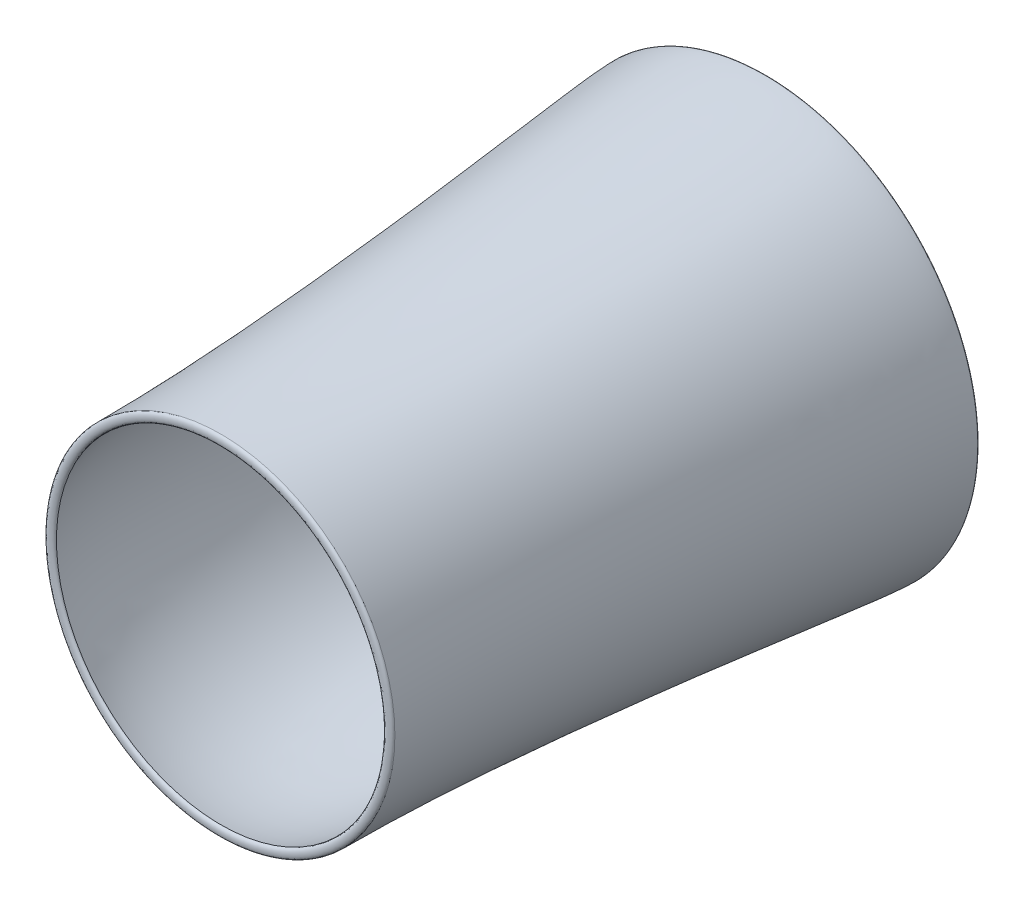
ISO-10303-21;
HEADER;
FILE_DESCRIPTION(('STEP AP214'),'2;1');
FILE_NAME('part.step','',(''),(''),'','','');
FILE_SCHEMA(('AUTOMOTIVE_DESIGN { 1 0 10303 214 1 1 1 1 }'));
ENDSEC;
DATA;
#1=APPLICATION_CONTEXT('core data for automotive mechanical design processes');
#2=APPLICATION_PROTOCOL_DEFINITION('international standard','automotive_design',2000,#1);
#3=PRODUCT_CONTEXT('',#1,'mechanical');
#4=PRODUCT('Part','Part','',(#3));
#5=PRODUCT_RELATED_PRODUCT_CATEGORY('part','',(#4));
#6=PRODUCT_DEFINITION_FORMATION('','',#4);
#7=PRODUCT_DEFINITION_CONTEXT('part definition',#1,'design');
#8=PRODUCT_DEFINITION('design','',#6,#7);
#9=PRODUCT_DEFINITION_SHAPE('','',#8);
#10=(LENGTH_UNIT() NAMED_UNIT(*) SI_UNIT(.MILLI.,.METRE.));
#11=(NAMED_UNIT(*) PLANE_ANGLE_UNIT() SI_UNIT($,.RADIAN.));
#12=(NAMED_UNIT(*) SI_UNIT($,.STERADIAN.) SOLID_ANGLE_UNIT());
#13=UNCERTAINTY_MEASURE_WITH_UNIT(LENGTH_MEASURE(1.E-05),#10,'distance_accuracy_value','');
#14=(GEOMETRIC_REPRESENTATION_CONTEXT(3) GLOBAL_UNCERTAINTY_ASSIGNED_CONTEXT((#13)) GLOBAL_UNIT_ASSIGNED_CONTEXT((#10,
#11,#12)) REPRESENTATION_CONTEXT('',''));
#15=CARTESIAN_POINT('',(0.,0.,0.));
#16=DIRECTION('',(0.,0.,1.));
#17=DIRECTION('',(1.,0.,0.));
#18=AXIS2_PLACEMENT_3D('',#15,#16,#17);
#19=CARTESIAN_POINT('',(-581.946550206298,0.,1834.64161446099));
#20=CARTESIAN_POINT('',(-581.946550206298,0.,1847.34161446099));
#21=CARTESIAN_POINT('',(-549.937537394715,0.,1847.34161446099));
#22=CARTESIAN_POINT('',(-549.937537394714,0.,1834.64161446099));
#23=B_SPLINE_CURVE_WITH_KNOTS('',3,(#19,#20,#21,#22),.UNSPECIFIED.,.F.,.F.,(4,4),(0.,1.),.UNSPECIFIED.);
#24=CARTESIAN_POINT('',(0.,0.,1104.75683012291));
#25=DIRECTION('',(0.,0.,1.));
#26=AXIS1_PLACEMENT('',#24,#25);
#27=SURFACE_OF_REVOLUTION('',#23,#26);
#28=CARTESIAN_POINT('',(0.,0.,1834.64161446099));
#29=DIRECTION('',(0.,0.,1.));
#30=DIRECTION('',(1.,0.,0.));
#31=AXIS2_PLACEMENT_3D('',#28,#29,#30);
#32=CIRCLE('',#31,549.937537394714);
#33=CARTESIAN_POINT('',(549.937537394714,0.,1834.64161446099));
#34=VERTEX_POINT('',#33);
#35=EDGE_CURVE('E47',#34,#34,#32,.T.);
#36=ORIENTED_EDGE('',*,*,#35,.F.);
#37=EDGE_LOOP('',(#36));
#38=FACE_BOUND('',#37,.T.);
#39=CARTESIAN_POINT('',(0.,0.,1834.64161446099));
#40=DIRECTION('',(0.,0.,1.));
#41=DIRECTION('',(1.,0.,0.));
#42=AXIS2_PLACEMENT_3D('',#39,#40,#41);
#43=CIRCLE('',#42,581.946550206298);
#44=CARTESIAN_POINT('',(581.946550206298,0.,1834.64161446099));
#45=VERTEX_POINT('',#44);
#46=EDGE_CURVE('E11',#45,#45,#43,.T.);
#47=ORIENTED_EDGE('',*,*,#46,.T.);
#48=EDGE_LOOP('',(#47));
#49=FACE_BOUND('',#48,.T.);
#50=ADVANCED_FACE('F40',(#38,#49),#27,.T.);
#51=CARTESIAN_POINT('',(-581.946550206298,0.,1834.64161446099));
#52=DIRECTION('',(0.,0.,1.));
#53=DIRECTION('',(1.,0.,0.));
#54=AXIS2_PLACEMENT_3D('',#51,#52,#53);
#55=PLANE('',#54);
#56=ORIENTED_EDGE('',*,*,#46,.F.);
#57=EDGE_LOOP('',(#56));
#58=FACE_BOUND('',#57,.T.);
#59=ORIENTED_EDGE('',*,*,#35,.T.);
#60=EDGE_LOOP('',(#59));
#61=FACE_BOUND('',#60,.T.);
#62=ADVANCED_FACE('F59',(#58,#61),#55,.F.);
#63=CLOSED_SHELL('',(#50,#62));
#64=MANIFOLD_SOLID_BREP('B2',#63);
#65=CARTESIAN_POINT('',(-535.765264218769,0.,15.5539732968266));
#66=CARTESIAN_POINT('',(-535.765264218769,0.,-1.37936003650685));
#67=CARTESIAN_POINT('',(-711.609923736489,0.,-1.37936003650663));
#68=CARTESIAN_POINT('',(-711.609923736489,0.,15.5539732968267));
#69=B_SPLINE_CURVE_WITH_KNOTS('',3,(#65,#66,#67,#68),.UNSPECIFIED.,.F.,.F.,(4,4),(0.,1.),.UNSPECIFIED.);
#70=CARTESIAN_POINT('',(0.,0.,99.6847843209707));
#71=DIRECTION('',(0.,0.,1.));
#72=AXIS1_PLACEMENT('',#70,#71);
#73=SURFACE_OF_REVOLUTION('',#69,#72);
#74=CARTESIAN_POINT('',(0.,0.,15.5539732968267));
#75=DIRECTION('',(0.,0.,1.));
#76=DIRECTION('',(1.,0.,0.));
#77=AXIS2_PLACEMENT_3D('',#74,#75,#76);
#78=CIRCLE('',#77,711.609923736489);
#79=CARTESIAN_POINT('',(711.609923736489,0.,15.5539732968267));
#80=VERTEX_POINT('',#79);
#81=EDGE_CURVE('E39',#80,#80,#78,.T.);
#82=ORIENTED_EDGE('',*,*,#81,.F.);
#83=EDGE_LOOP('',(#82));
#84=FACE_BOUND('',#83,.T.);
#85=CARTESIAN_POINT('',(0.,0.,15.5539732968266));
#86=DIRECTION('',(0.,0.,1.));
#87=DIRECTION('',(1.,0.,0.));
#88=AXIS2_PLACEMENT_3D('',#85,#86,#87);
#89=CIRCLE('',#88,535.765264218769);
#90=CARTESIAN_POINT('',(535.765264218769,0.,15.5539732968266));
#91=VERTEX_POINT('',#90);
#92=EDGE_CURVE('E93',#91,#91,#89,.T.);
#93=ORIENTED_EDGE('',*,*,#92,.T.);
#94=EDGE_LOOP('',(#93));
#95=FACE_BOUND('',#94,.T.);
#96=ADVANCED_FACE('F86',(#84,#95),#73,.T.);
#97=CARTESIAN_POINT('',(-711.609923736489,0.,15.5539732968267));
#98=DIRECTION('',(0.,0.,-1.));
#99=DIRECTION('',(-1.,0.,0.));
#100=AXIS2_PLACEMENT_3D('',#97,#98,#99);
#101=PLANE('',#100);
#102=ORIENTED_EDGE('',*,*,#92,.F.);
#103=EDGE_LOOP('',(#102));
#104=FACE_BOUND('',#103,.T.);
#105=ORIENTED_EDGE('',*,*,#81,.T.);
#106=EDGE_LOOP('',(#105));
#107=FACE_BOUND('',#106,.T.);
#108=ADVANCED_FACE('F106',(#104,#107),#101,.F.);
#109=CLOSED_SHELL('',(#96,#108));
#110=MANIFOLD_SOLID_BREP('B6',#109);
#111=CARTESIAN_POINT('',(-549.937537394714,0.,1834.64161446099));
#112=CARTESIAN_POINT('',(-643.254530462499,0.,1479.81660780256));
#113=CARTESIAN_POINT('',(-472.632532818802,0.,729.064881211395));
#114=CARTESIAN_POINT('',(-621.688080132443,0.,211.8838387139));
#115=CARTESIAN_POINT('',(-535.765264218769,0.,15.5539732968267));
#116=B_SPLINE_CURVE_WITH_KNOTS('',3,(#111,#112,#113,#114,#115),.UNSPECIFIED.,.F.,.F.,(4,1,4),
(0.,0.793493092504956,1.),.UNSPECIFIED.);
#117=CARTESIAN_POINT('',(0.,0.,99.6847843209707));
#118=DIRECTION('',(0.,0.,1.));
#119=AXIS1_PLACEMENT('',#117,#118);
#120=SURFACE_OF_REVOLUTION('',#116,#119);
#121=CARTESIAN_POINT('',(0.,0.,15.5539732968267));
#122=DIRECTION('',(0.,0.,1.));
#123=DIRECTION('',(1.,0.,0.));
#124=AXIS2_PLACEMENT_3D('',#121,#122,#123);
#125=CIRCLE('',#124,535.765264218769);
#126=CARTESIAN_POINT('',(535.765264218769,0.,15.5539732968267));
#127=VERTEX_POINT('',#126);
#128=EDGE_CURVE('E140',#127,#127,#125,.T.);
#129=ORIENTED_EDGE('',*,*,#128,.F.);
#130=EDGE_LOOP('',(#129));
#131=FACE_BOUND('',#130,.T.);
#132=CARTESIAN_POINT('',(0.,0.,1834.64161446099));
#133=DIRECTION('',(0.,0.,1.));
#134=DIRECTION('',(1.,0.,0.));
#135=AXIS2_PLACEMENT_3D('',#132,#133,#134);
#136=CIRCLE('',#135,549.937537394714);
#137=CARTESIAN_POINT('',(549.937537394714,0.,1834.64161446099));
#138=VERTEX_POINT('',#137);
#139=EDGE_CURVE('E85',#138,#138,#136,.T.);
#140=ORIENTED_EDGE('',*,*,#139,.T.);
#141=EDGE_LOOP('',(#140));
#142=FACE_BOUND('',#141,.T.);
#143=ADVANCED_FACE('F125',(#131,#142),#120,.T.);
#144=CARTESIAN_POINT('',(-549.937537394714,0.,1834.64161446099));
#145=DIRECTION('',(0.,0.,-1.));
#146=DIRECTION('',(-1.,0.,0.));
#147=AXIS2_PLACEMENT_3D('',#144,#145,#146);
#148=PLANE('',#147);
#149=ORIENTED_EDGE('',*,*,#139,.F.);
#150=EDGE_LOOP('',(#149));
#151=FACE_BOUND('',#150,.T.);
#152=CARTESIAN_POINT('',(0.,0.,1834.64161446099));
#153=DIRECTION('',(0.,0.,1.));
#154=DIRECTION('',(1.,0.,0.));
#155=AXIS2_PLACEMENT_3D('',#152,#153,#154);
#156=CIRCLE('',#155,581.946550206298);
#157=CARTESIAN_POINT('',(581.946550206298,0.,1834.64161446099));
#158=VERTEX_POINT('',#157);
#159=EDGE_CURVE('E132',#158,#158,#156,.T.);
#160=ORIENTED_EDGE('',*,*,#159,.T.);
#161=EDGE_LOOP('',(#160));
#162=FACE_BOUND('',#161,.T.);
#163=ADVANCED_FACE('F159',(#151,#162),#148,.F.);
#164=CARTESIAN_POINT('',(-711.609923736489,0.,15.5539732968267));
#165=CARTESIAN_POINT('',(-711.609923736489,0.,140.937925673119));
#166=CARTESIAN_POINT('',(-581.946550206297,0.,1104.33249407573));
#167=CARTESIAN_POINT('',(-581.946550206298,0.,1834.64161446099));
#168=B_SPLINE_CURVE_WITH_KNOTS('',3,(#164,#165,#166,#167),.UNSPECIFIED.,.F.,.F.,(4,4),(0.,1.),.UNSPECIFIED.);
#169=CARTESIAN_POINT('',(0.,0.,99.6847843209707));
#170=DIRECTION('',(0.,0.,1.));
#171=AXIS1_PLACEMENT('',#169,#170);
#172=SURFACE_OF_REVOLUTION('',#168,#171);
#173=ORIENTED_EDGE('',*,*,#159,.F.);
#174=EDGE_LOOP('',(#173));
#175=FACE_BOUND('',#174,.T.);
#176=CARTESIAN_POINT('',(0.,0.,15.5539732968267));
#177=DIRECTION('',(0.,0.,1.));
#178=DIRECTION('',(1.,0.,0.));
#179=AXIS2_PLACEMENT_3D('',#176,#177,#178);
#180=CIRCLE('',#179,711.609923736489);
#181=CARTESIAN_POINT('',(711.609923736489,0.,15.5539732968267));
#182=VERTEX_POINT('',#181);
#183=EDGE_CURVE('E136',#182,#182,#180,.T.);
#184=ORIENTED_EDGE('',*,*,#183,.T.);
#185=EDGE_LOOP('',(#184));
#186=FACE_BOUND('',#185,.T.);
#187=ADVANCED_FACE('F155',(#175,#186),#172,.T.);
#188=CARTESIAN_POINT('',(-535.765264218769,0.,15.5539732968267));
#189=DIRECTION('',(0.,0.,1.));
#190=DIRECTION('',(1.,0.,0.));
#191=AXIS2_PLACEMENT_3D('',#188,#189,#190);
#192=PLANE('',#191);
#193=ORIENTED_EDGE('',*,*,#183,.F.);
#194=EDGE_LOOP('',(#193));
#195=FACE_BOUND('',#194,.T.);
#196=ORIENTED_EDGE('',*,*,#128,.T.);
#197=EDGE_LOOP('',(#196));
#198=FACE_BOUND('',#197,.T.);
#199=ADVANCED_FACE('F158',(#195,#198),#192,.F.);
#200=CLOSED_SHELL('',(#143,#163,#187,#199));
#201=MANIFOLD_SOLID_BREP('B34',#200);
#202=ADVANCED_BREP_SHAPE_REPRESENTATION('',(#18,#64,#110,#201),#14);
#203=SHAPE_DEFINITION_REPRESENTATION(#9,#202);
ENDSEC;
END-ISO-10303-21;
